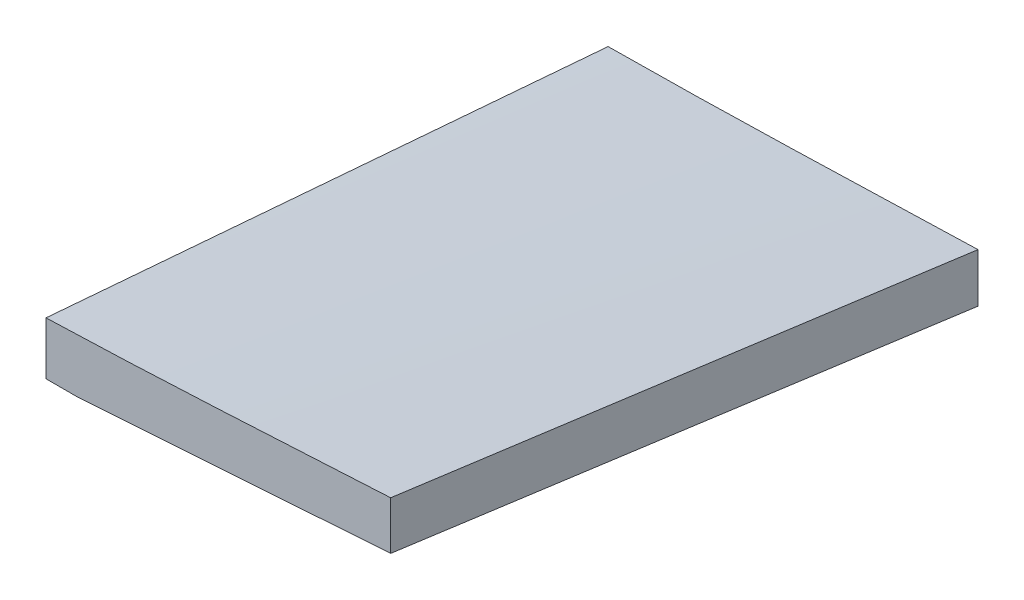
ISO-10303-21;
HEADER;
FILE_DESCRIPTION(('STEP AP214'),'2;1');
FILE_NAME('part.step','',(''),(''),'','','');
FILE_SCHEMA(('AUTOMOTIVE_DESIGN { 1 0 10303 214 1 1 1 1 }'));
ENDSEC;
DATA;
#1=APPLICATION_CONTEXT('core data for automotive mechanical design processes');
#2=APPLICATION_PROTOCOL_DEFINITION('international standard','automotive_design',2000,#1);
#3=PRODUCT_CONTEXT('',#1,'mechanical');
#4=PRODUCT('Part','Part','',(#3));
#5=PRODUCT_RELATED_PRODUCT_CATEGORY('part','',(#4));
#6=PRODUCT_DEFINITION_FORMATION('','',#4);
#7=PRODUCT_DEFINITION_CONTEXT('part definition',#1,'design');
#8=PRODUCT_DEFINITION('design','',#6,#7);
#9=PRODUCT_DEFINITION_SHAPE('','',#8);
#10=(LENGTH_UNIT() NAMED_UNIT(*) SI_UNIT(.MILLI.,.METRE.));
#11=(NAMED_UNIT(*) PLANE_ANGLE_UNIT() SI_UNIT($,.RADIAN.));
#12=(NAMED_UNIT(*) SI_UNIT($,.STERADIAN.) SOLID_ANGLE_UNIT());
#13=UNCERTAINTY_MEASURE_WITH_UNIT(LENGTH_MEASURE(1.E-05),#10,'distance_accuracy_value','');
#14=(GEOMETRIC_REPRESENTATION_CONTEXT(3) GLOBAL_UNCERTAINTY_ASSIGNED_CONTEXT((#13)) GLOBAL_UNIT_ASSIGNED_CONTEXT((#10,
#11,#12)) REPRESENTATION_CONTEXT('',''));
#15=CARTESIAN_POINT('',(0.,0.,0.));
#16=DIRECTION('',(0.,0.,1.));
#17=DIRECTION('',(1.,0.,0.));
#18=AXIS2_PLACEMENT_3D('',#15,#16,#17);
#19=CARTESIAN_POINT('',(122.012987748225,6.34998004884585,335.28));
#20=DIRECTION('',(1.,0.,0.));
#21=DIRECTION('',(0.,1.,0.));
#22=AXIS2_PLACEMENT_3D('',#19,#20,#21);
#23=PLANE('',#22);
#24=CARTESIAN_POINT('',(122.012987748225,-12.8181238056028,477.520000000027));
#25=CARTESIAN_POINT('',(122.012987748225,-10.2309538996958,510.752779958252));
#26=CARTESIAN_POINT('',(122.012987748225,-7.64426444405944,543.98559730753));
#27=CARTESIAN_POINT('',(122.012987748225,-3.954516160517,591.398961223956));
#28=CARTESIAN_POINT('',(122.012987748225,-2.85106435992717,605.579477207998));
#29=CARTESIAN_POINT('',(122.012987748225,-1.74770003692421,619.759999999985));
#30=B_SPLINE_CURVE_WITH_KNOTS('',3,(#24,#25,#26,#27,#28,#29),.UNSPECIFIED.,.F.,.F.,(4,2,4),(0.,
100.000000008964,142.670150642037),.UNSPECIFIED.);
#31=CARTESIAN_POINT('',(122.012987748225,-12.8181238056028,477.520000000027));
#32=VERTEX_POINT('',#31);
#33=CARTESIAN_POINT('',(122.012987748225,-1.74770003692419,619.759999999985));
#34=VERTEX_POINT('',#33);
#35=EDGE_CURVE('E104',#32,#34,#30,.T.);
#36=ORIENTED_EDGE('',*,*,#35,.T.);
#37=DIRECTION('',(0.,1.,0.));
#38=VECTOR('',#37,1.);
#39=CARTESIAN_POINT('',(122.012987748225,6.34998004884585,619.76));
#40=LINE('',#39,#38);
#41=CARTESIAN_POINT('',(122.012987748225,11.6136738216531,619.759999999985));
#42=VERTEX_POINT('',#41);
#43=EDGE_CURVE('E51',#34,#42,#40,.T.);
#44=ORIENTED_EDGE('',*,*,#43,.T.);
#45=CARTESIAN_POINT('',(122.012987748225,11.6136738216531,619.759999999985));
#46=CARTESIAN_POINT('',(122.012987748225,9.67010293276692,596.053266549237));
#47=CARTESIAN_POINT('',(122.012987748225,7.72612491566221,572.346566490533));
#48=CARTESIAN_POINT('',(122.012987748225,3.83735462501573,524.933233157214));
#49=CARTESIAN_POINT('',(122.012987748225,1.89256235147395,501.226599882598));
#50=CARTESIAN_POINT('',(122.012987748225,-0.0526370502863722,477.520000000027));
#51=B_SPLINE_CURVE_WITH_KNOTS('',3,(#45,#46,#47,#48,#49,#50),.UNSPECIFIED.,.F.,.F.,(4,2,4),(0.,
71.3588123768819,142.717624753764),.UNSPECIFIED.);
#52=CARTESIAN_POINT('',(122.012987748225,-0.0526370502863598,477.520000000027));
#53=VERTEX_POINT('',#52);
#54=EDGE_CURVE('E71',#42,#53,#51,.T.);
#55=ORIENTED_EDGE('',*,*,#54,.T.);
#56=DIRECTION('',(0.,1.,0.));
#57=VECTOR('',#56,1.);
#58=CARTESIAN_POINT('',(122.012987748225,6.34998004884585,477.52));
#59=LINE('',#58,#57);
#60=EDGE_CURVE('E11',#32,#53,#59,.T.);
#61=ORIENTED_EDGE('',*,*,#60,.F.);
#62=EDGE_LOOP('',(#36,#44,#55,#61));
#63=FACE_BOUND('',#62,.T.);
#64=ADVANCED_FACE('F44',(#63),#23,.F.);
#65=CARTESIAN_POINT('',(0.,0.,619.76));
#66=DIRECTION('',(0.,0.,-1.));
#67=DIRECTION('',(-1.,0.,0.));
#68=AXIS2_PLACEMENT_3D('',#65,#66,#67);
#69=PLANE('',#68);
#70=DIRECTION('',(1.,0.,0.));
#71=VECTOR('',#70,1.);
#72=CARTESIAN_POINT('',(104.715608500928,-1.74770003692308,619.76));
#73=LINE('',#72,#71);
#74=CARTESIAN_POINT('',(129.715608500912,-1.74770003690514,619.76000000023));
#75=VERTEX_POINT('',#74);
#76=EDGE_CURVE('E159',#34,#75,#73,.T.);
#77=ORIENTED_EDGE('',*,*,#76,.T.);
#78=CARTESIAN_POINT('',(129.715608500928,-1.74770003692304,619.76));
#79=CARTESIAN_POINT('',(136.6265871033,-1.28365344115263,619.76));
#80=CARTESIAN_POINT('',(143.537565705671,-0.819606845382206,619.76));
#81=CARTESIAN_POINT('',(157.359522910415,0.108486346158673,619.76));
#82=CARTESIAN_POINT('',(164.270501512787,0.572532941929125,619.76));
#83=CARTESIAN_POINT('',(183.864602522024,1.88820419395677,619.76));
#84=CARTESIAN_POINT('',(196.547724928889,2.73982885021397,619.76));
#85=CARTESIAN_POINT('',(209.230847335754,3.59145350647108,619.76));
#86=B_SPLINE_CURVE_WITH_KNOTS('',3,(#78,#79,#80,#81,#82,#83,#84,#85),.UNSPECIFIED.,.F.,.F.,(4,2,
2,4),(0.,20.7796217571299,41.5592435142597,79.694289428537),.UNSPECIFIED.);
#87=CARTESIAN_POINT('',(209.230847335754,3.59145350647108,619.76));
#88=VERTEX_POINT('',#87);
#89=EDGE_CURVE('E109',#75,#88,#86,.T.);
#90=ORIENTED_EDGE('',*,*,#89,.T.);
#91=DIRECTION('',(0.,1.,0.));
#92=VECTOR('',#91,1.);
#93=CARTESIAN_POINT('',(209.230847335755,-23.8937090007613,619.76));
#94=LINE('',#93,#92);
#95=CARTESIAN_POINT('',(209.230847335754,15.7935965768529,619.76));
#96=VERTEX_POINT('',#95);
#97=EDGE_CURVE('E106',#88,#96,#94,.T.);
#98=ORIENTED_EDGE('',*,*,#97,.T.);
#99=CARTESIAN_POINT('',(209.230847335754,15.7935965768529,619.76));
#100=CARTESIAN_POINT('',(207.41455686942,15.6924259805078,619.76));
#101=CARTESIAN_POINT('',(205.59822489933,15.5920060372144,619.76));
#102=CARTESIAN_POINT('',(201.965503035907,15.3922434325193,619.76));
#103=CARTESIAN_POINT('',(200.149113142617,15.2929007703145,619.76));
#104=CARTESIAN_POINT('',(196.516298559292,15.0948685949099,619.76));
#105=CARTESIAN_POINT('',(194.699873869272,14.9961790814402,619.76));
#106=CARTESIAN_POINT('',(191.066983914362,14.799556288656,619.76));
#107=CARTESIAN_POINT('',(189.250518649481,14.7016230091847,619.76));
#108=CARTESIAN_POINT('',(185.617613897391,14.506447661882,619.76));
#109=CARTESIAN_POINT('',(183.801174411456,14.4092055703053,619.76));
#110=CARTESIAN_POINT('',(180.168263251,14.2153050009613,619.76));
#111=CARTESIAN_POINT('',(178.351791576461,14.118646523525,619.76));
#112=CARTESIAN_POINT('',(175.627056123042,13.9741674535704,619.76));
#113=CARTESIAN_POINT('',(174.718805829373,13.9260925123853,619.76));
#114=CARTESIAN_POINT('',(172.902296675919,13.8301047893721,619.76));
#115=CARTESIAN_POINT('',(171.994037816134,13.7821920075444,619.76));
#116=CARTESIAN_POINT('',(169.26922968809,13.6389887519546,619.76));
#117=CARTESIAN_POINT('',(167.452652180701,13.5442335446287,619.76));
#118=CARTESIAN_POINT('',(163.819174875551,13.3571040707853,619.76));
#119=CARTESIAN_POINT('',(162.00227506427,13.2647300658146,619.76));
#120=CARTESIAN_POINT('',(158.368307089354,13.083401958186,619.76));
#121=CARTESIAN_POINT('',(156.551238925987,12.9944478501378,619.76));
#122=CARTESIAN_POINT('',(152.91690965229,12.8207031406438,619.76));
#123=CARTESIAN_POINT('',(151.099648542678,12.7359125241909,619.76));
#124=CARTESIAN_POINT('',(147.464914387711,12.5711121863996,619.76));
#125=CARTESIAN_POINT('',(145.647441343007,12.491102450726,619.76));
#126=CARTESIAN_POINT('',(142.012216761942,12.3364801875576,619.76));
#127=CARTESIAN_POINT('',(140.194465219438,12.2618678043317,619.76));
#128=CARTESIAN_POINT('',(136.55874343715,12.1179672827826,619.76));
#129=CARTESIAN_POINT('',(134.740773196422,12.0486791682962,619.76));
#130=CARTESIAN_POINT('',(131.10461974591,11.9153508402923,619.76));
#131=CARTESIAN_POINT('',(129.286436533956,11.8513106859325,619.76));
#132=CARTESIAN_POINT('',(125.649858896885,11.7285170643905,619.76));
#133=CARTESIAN_POINT('',(123.831464468559,11.6697636922556,619.76));
#134=CARTESIAN_POINT('',(122.012987748173,11.6136738216527,619.76));
#135=B_SPLINE_CURVE_WITH_KNOTS('',3,(#99,#100,#101,#102,#103,#104,#105,#106,#107,#108,#109,#110,
#111,#112,#113,#114,#115,#116,#117,#118,#119,#120,#121,#122,#123,#124,#125,#126,#127,#128,#129,
#130,#131,#132,#133,#134),.UNSPECIFIED.,.F.,.F.,(4,2,2,2,2,2,2,2,2,2,2,2,2,2,2,2,2,4),(0.,
5.45731732806995,10.9146305873691,16.371941591456,21.829251464457,27.2863729411962,
32.7434975130182,35.4720627165319,38.2006279269674,43.6577682906292,49.1155055237518,
54.5732341540616,60.0309431107681,65.4886357019918,70.9464741211801,76.4043369737113,
81.8622613415949,87.3202838140671),.UNSPECIFIED.);
#136=EDGE_CURVE('E96',#96,#42,#135,.T.);
#137=ORIENTED_EDGE('',*,*,#136,.T.);
#138=ORIENTED_EDGE('',*,*,#43,.F.);
#139=EDGE_LOOP('',(#77,#90,#98,#137,#138));
#140=FACE_BOUND('',#139,.T.);
#141=ADVANCED_FACE('F108',(#140),#69,.F.);
#142=CARTESIAN_POINT('',(0.,0.,477.52));
#143=DIRECTION('',(0.,0.,-1.));
#144=DIRECTION('',(-1.,0.,0.));
#145=AXIS2_PLACEMENT_3D('',#142,#143,#144);
#146=PLANE('',#145);
#147=DIRECTION('',(1.,0.,0.));
#148=VECTOR('',#147,1.);
#149=CARTESIAN_POINT('',(114.323209263802,-12.8181238056049,477.52));
#150=LINE('',#149,#148);
#151=CARTESIAN_POINT('',(139.3232092638,-12.8181238056026,477.520000000029));
#152=VERTEX_POINT('',#151);
#153=EDGE_CURVE('E123',#32,#152,#150,.T.);
#154=ORIENTED_EDGE('',*,*,#153,.F.);
#155=ORIENTED_EDGE('',*,*,#60,.T.);
#156=CARTESIAN_POINT('',(215.621917541989,2.25574454634471,477.52));
#157=CARTESIAN_POINT('',(214.647044605365,2.224288392323,477.52));
#158=CARTESIAN_POINT('',(213.67216500944,2.19303949664612,477.52));
#159=CARTESIAN_POINT('',(211.722394914279,2.13088505525722,477.52));
#160=CARTESIAN_POINT('',(210.747504415045,2.09997950952898,477.52));
#161=CARTESIAN_POINT('',(208.797715604077,2.03844062258157,477.52));
#162=CARTESIAN_POINT('',(207.82281729235,2.00780728114808,477.52));
#163=CARTESIAN_POINT('',(205.873014622828,1.94673327865421,477.52));
#164=CARTESIAN_POINT('',(204.898110265033,1.91629261759682,477.52));
#165=CARTESIAN_POINT('',(201.973390033636,1.82523005415367,477.52));
#166=CARTESIAN_POINT('',(200.023566075061,1.76486754230643,477.52));
#167=CARTESIAN_POINT('',(196.123895541607,1.64489301308431,477.52));
#168=CARTESIAN_POINT('',(194.174048966735,1.58528099552785,477.52));
#169=CARTESIAN_POINT('',(190.274399309307,1.46677611513231,477.52));
#170=CARTESIAN_POINT('',(188.324596227481,1.40788322828511,477.52));
#171=CARTESIAN_POINT('',(184.42496974022,1.29073730791751,477.52));
#172=CARTESIAN_POINT('',(182.475146334773,1.23248427475644,477.52));
#173=CARTESIAN_POINT('',(179.550393645504,1.14566147571709,477.52));
#174=CARTESIAN_POINT('',(178.575472624049,1.1168133190096,477.52));
#175=CARTESIAN_POINT('',(176.625625349061,1.0592944631072,477.52));
#176=CARTESIAN_POINT('',(175.650699095529,1.0306237639128,477.52));
#177=CARTESIAN_POINT('',(172.725900323917,0.945169580461794,477.52));
#178=CARTESIAN_POINT('',(170.776011391535,0.888944118170222,477.52));
#179=CARTESIAN_POINT('',(166.875956369448,0.77899210724675,477.52));
#180=CARTESIAN_POINT('',(164.925790272231,0.72526582335519,477.52));
#181=CARTESIAN_POINT('',(161.025365213215,0.621389081226013,477.52));
#182=CARTESIAN_POINT('',(159.075106251561,0.571238617557935,477.52));
#183=CARTESIAN_POINT('',(155.174486893242,0.47532787099128,477.52));
#184=CARTESIAN_POINT('',(153.224126496968,0.429567572283645,477.52));
#185=CARTESIAN_POINT('',(149.323298336082,0.343127637481132,477.52));
#186=CARTESIAN_POINT('',(147.372830571813,0.30244798599696,477.52));
#187=CARTESIAN_POINT('',(143.471732392745,0.226864321897372,477.52));
#188=CARTESIAN_POINT('',(141.521101975046,0.191960458572466,477.52));
#189=CARTESIAN_POINT('',(137.619739338344,0.127837378134033,477.52));
#190=CARTESIAN_POINT('',(135.669007118928,0.098618186243909,477.52));
#191=CARTESIAN_POINT('',(131.767444825237,0.0457651582251589,477.52));
#192=CARTESIAN_POINT('',(129.81661475011,0.0221313848305931,477.52));
#193=CARTESIAN_POINT('',(126.890307741431,-0.00911154197840539,477.52));
#194=CARTESIAN_POINT('',(125.914852880334,-0.0188246312667157,477.52));
#195=CARTESIAN_POINT('',(123.963929885645,-0.0368154889645691,477.52));
#196=CARTESIAN_POINT('',(122.988461752051,-0.0450932573088259,477.52));
#197=CARTESIAN_POINT('',(122.012987748173,-0.052637050288963,477.52));
#198=B_SPLINE_CURVE_WITH_KNOTS('',3,(#156,#157,#158,#159,#160,#161,#162,#163,#164,#165,#166,
#167,#168,#169,#170,#171,#172,#173,#174,#175,#176,#177,#178,#179,#180,#181,#182,#183,#184,#185,
#186,#187,#188,#189,#190,#191,#192,#193,#194,#195,#196,#197),.UNSPECIFIED.,.F.,.F.,(4,2,2,2,2,2,
2,2,2,2,2,2,2,2,2,2,2,2,2,2,4),(0.,2.92614084149174,5.85228154467963,8.77841994370649,
11.7045583880756,17.5568324945537,23.4091051850171,29.2611819606866,35.1132620224934,
38.0393052238479,40.9653484336475,46.8174456482294,52.6701613758528,58.5228682149949,
64.375553977651,70.2282220120763,76.0810413005542,81.9338865579291,87.7867975499124,
90.7133063005583,93.6398151843176),.UNSPECIFIED.);
#199=CARTESIAN_POINT('',(215.621917541989,2.25574454634471,477.52));
#200=VERTEX_POINT('',#199);
#201=EDGE_CURVE('E64',#200,#53,#198,.T.);
#202=ORIENTED_EDGE('',*,*,#201,.F.);
#203=DIRECTION('',(0.,1.,0.));
#204=VECTOR('',#203,1.);
#205=CARTESIAN_POINT('',(215.62191754199,-23.8937090007613,477.52));
#206=LINE('',#205,#204);
#207=CARTESIAN_POINT('',(215.621917541989,-10.1485424623587,477.52));
#208=VERTEX_POINT('',#207);
#209=EDGE_CURVE('E114',#208,#200,#206,.T.);
#210=ORIENTED_EDGE('',*,*,#209,.F.);
#211=CARTESIAN_POINT('',(139.323209263802,-12.8181238056049,477.52));
#212=CARTESIAN_POINT('',(146.245514006947,-12.5759223842232,477.52));
#213=CARTESIAN_POINT('',(153.167818750092,-12.3337209628415,477.52));
#214=CARTESIAN_POINT('',(167.012428236382,-11.8493181200781,477.52));
#215=CARTESIAN_POINT('',(173.934732979527,-11.6071166986964,477.52));
#216=CARTESIAN_POINT('',(192.445330995778,-10.9594576723294,477.52));
#217=CARTESIAN_POINT('',(204.033624268884,-10.554000067344,477.52));
#218=CARTESIAN_POINT('',(215.621917541989,-10.1485424623587,477.52));
#219=B_SPLINE_CURVE_WITH_KNOTS('',3,(#211,#212,#213,#214,#215,#216,#217,#218),.UNSPECIFIED.,.F.,
.F.,(4,2,2,4),(0.,20.7796217571299,41.5592435142597,76.3453963868684),.UNSPECIFIED.);
#220=EDGE_CURVE('E201',#152,#208,#219,.T.);
#221=ORIENTED_EDGE('',*,*,#220,.F.);
#222=EDGE_LOOP('',(#154,#155,#202,#210,#221));
#223=FACE_BOUND('',#222,.T.);
#224=ADVANCED_FACE('F166',(#223),#146,.T.);
#225=CARTESIAN_POINT('',(222.012987748225,-23.8937090007613,335.28));
#226=DIRECTION('',(0.998992101682105,0.,0.0448863094581294));
#227=DIRECTION('',(0.,1.,0.));
#228=AXIS2_PLACEMENT_3D('',#225,#226,#227);
#229=PLANE('',#228);
#230=CARTESIAN_POINT('',(222.012987748225,-23.8937090007613,335.28));
#231=CARTESIAN_POINT('',(215.621950375233,-10.1464646900732,477.519269261564));
#232=CARTESIAN_POINT('',(209.230888497717,3.59504253956158,619.759083897143));
#233=CARTESIAN_POINT('',(202.839777129521,17.3249682784286,762.));
#234=B_SPLINE_CURVE_WITH_KNOTS('',3,(#230,#231,#232,#233),.UNSPECIFIED.,.F.,.F.,(4,4),(0.,1.),.UNSPECIFIED.);
#235=EDGE_CURVE('E118',#208,#88,#234,.T.);
#236=ORIENTED_EDGE('',*,*,#235,.F.);
#237=ORIENTED_EDGE('',*,*,#209,.T.);
#238=CARTESIAN_POINT('',(222.012987748225,-11.2872773614073,335.28));
#239=CARTESIAN_POINT('',(215.621950375233,2.25782306949605,477.519269261564));
#240=CARTESIAN_POINT('',(209.230888497717,15.7971864193462,619.759083897143));
#241=CARTESIAN_POINT('',(202.839777129521,29.3249682784286,762.));
#242=B_SPLINE_CURVE_WITH_KNOTS('',3,(#238,#239,#240,#241),.UNSPECIFIED.,.F.,.F.,(4,4),(0.,1.),.UNSPECIFIED.);
#243=EDGE_CURVE('E100',#200,#96,#242,.T.);
#244=ORIENTED_EDGE('',*,*,#243,.T.);
#245=ORIENTED_EDGE('',*,*,#97,.F.);
#246=EDGE_LOOP('',(#236,#237,#244,#245));
#247=FACE_BOUND('',#246,.T.);
#248=ADVANCED_FACE('F116',(#247),#229,.T.);
#249=CARTESIAN_POINT('',(222.012987748225,-11.2872773614073,335.28));
#250=CARTESIAN_POINT('',(215.621950375233,2.25782306949605,477.519269261564));
#251=CARTESIAN_POINT('',(209.230888497717,15.7971864193462,619.759083897143));
#252=CARTESIAN_POINT('',(202.839777129521,29.3249682784286,762.));
#253=CARTESIAN_POINT('',(218.569474026706,-11.3263744236417,335.28));
#254=CARTESIAN_POINT('',(212.364886061197,2.15272535408958,477.519269261564));
#255=CARTESIAN_POINT('',(206.160273591164,15.6260880507676,619.759083897143));
#256=CARTESIAN_POINT('',(199.955611630451,29.0878692566778,762.));
#257=CARTESIAN_POINT('',(211.614338336714,-11.4024470677598,335.28));
#258=CARTESIAN_POINT('',(205.825097972641,1.94636141574157,477.519269261565));
#259=CARTESIAN_POINT('',(200.035833104044,15.2894328181897,619.759083897143));
#260=CARTESIAN_POINT('',(194.246518744766,28.62092272987,762.));
#261=CARTESIAN_POINT('',(201.046202820784,-11.5155355801604,335.28));
#262=CARTESIAN_POINT('',(195.960183316022,1.64100708519495,477.519269261564));
#263=CARTESIAN_POINT('',(190.874139306737,14.791812669497,619.759083897143));
#264=CARTESIAN_POINT('',(185.788045806771,27.9310367630314,762.));
#265=CARTESIAN_POINT('',(190.421562401009,-11.6239646215105,335.28));
#266=CARTESIAN_POINT('',(186.071163978279,1.34135026762067,477.519269261564));
#267=CARTESIAN_POINT('',(181.720741051026,14.3009280756986,619.759083897143));
#268=CARTESIAN_POINT('',(177.370268633092,27.2489243930088,761.999999999999));
#269=CARTESIAN_POINT('',(183.356302448994,-11.6915854526342,335.28));
#270=CARTESIAN_POINT('',(179.48576660961,1.1454855942834,477.519269261564));
#271=CARTESIAN_POINT('',(175.615206265701,13.9768195601478,619.759083897143));
#272=CARTESIAN_POINT('',(171.744596431112,26.7965720352444,762.));
#273=CARTESIAN_POINT('',(174.388523129358,-11.7731432923107,335.28));
#274=CARTESIAN_POINT('',(171.103001578197,0.899059371477806,477.519269261564));
#275=CARTESIAN_POINT('',(167.817455522512,13.5655249542131,619.759083897143));
#276=CARTESIAN_POINT('',(164.531859976147,26.2204090461806,762.));
#277=CARTESIAN_POINT('',(163.489709248502,-11.8633262155867,335.28));
#278=CARTESIAN_POINT('',(160.910936734288,0.60773809662375,477.519269261564));
#279=CARTESIAN_POINT('',(158.33213971555,13.073065327781,619.759083897143));
#280=CARTESIAN_POINT('',(155.753293206132,25.5268110681705,761.999999999999));
#281=CARTESIAN_POINT('',(147.154849918996,-11.9140829368556,335.28));
#282=CARTESIAN_POINT('',(145.626036317623,0.251017379627905,477.519269261565));
#283=CARTESIAN_POINT('',(144.097198211725,12.4103806150582,619.759083897144));
#284=CARTESIAN_POINT('',(142.568310615148,24.5581623597207,762.000000000001));
#285=CARTESIAN_POINT('',(133.547087797304,-11.8513571386047,335.28));
#286=CARTESIAN_POINT('',(132.888447204188,0.0521462593199381,477.519269261564));
#287=CARTESIAN_POINT('',(132.229782106547,11.9499125761914,619.759083897143));
#288=CARTESIAN_POINT('',(131.571067518226,23.8360974022951,762.));
#289=CARTESIAN_POINT('',(122.659949238186,-11.7410017797558,335.280000000001));
#290=CARTESIAN_POINT('',(122.697140743006,-0.0501019891075296,477.519269261565));
#291=CARTESIAN_POINT('',(122.734307743302,11.6350607204876,619.759083897143));
#292=CARTESIAN_POINT('',(122.771425252918,23.3086419393149,762.));
#293=CARTESIAN_POINT('',(114.493192339325,-11.6262316691835,335.28));
#294=CARTESIAN_POINT('',(115.052736661929,-0.0970194846432594,477.519269261564));
#295=CARTESIAN_POINT('',(115.612256480008,11.4264556188438,619.759083897143));
#296=CARTESIAN_POINT('',(116.171726807407,22.938349231563,761.999999999999));
#297=CARTESIAN_POINT('',(106.324095444975,-11.4813070111323,335.28));
#298=CARTESIAN_POINT('',(107.407102717467,-0.115334106030914,477.519269261564));
#299=CARTESIAN_POINT('',(108.490085485435,11.2449017180172,619.759083897143));
#300=CARTESIAN_POINT('',(109.573018762723,22.5935560512976,762.));
#301=CARTESIAN_POINT('',(98.1517013141778,-11.3060491598229,335.28));
#302=CARTESIAN_POINT('',(99.7599490935271,-0.105289853007253,477.519269261565));
#303=CARTESIAN_POINT('',(101.368172368352,11.0897323727552,619.759083897144));
#304=CARTESIAN_POINT('',(102.976346152497,22.2731731077499,762.000000000001));
#305=CARTESIAN_POINT('',(89.9750279012389,-11.1021701951475,335.28));
#306=CARTESIAN_POINT('',(92.1109614058318,-0.0686157488297257,477.519269261564));
#307=CARTESIAN_POINT('',(94.2468704059006,10.9592016164349,619.759083897143));
#308=CARTESIAN_POINT('',(96.3827299152893,21.9754374909317,762.));
#309=CARTESIAN_POINT('',(81.7931246917491,-10.8683806880935,335.28));
#310=CARTESIAN_POINT('',(84.4597450626571,-0.00268226262042188,477.519269261565));
#311=CARTESIAN_POINT('',(87.1263409290411,10.8572790817994,619.759083897144));
#312=CARTESIAN_POINT('',(89.7928873047449,21.7056589354515,762.));
#313=CARTESIAN_POINT('',(73.6060212603565,-10.5736728833086,335.279999999999));
#314=CARTESIAN_POINT('',(76.8063043911992,0.122433158677056,477.519269261564));
#315=CARTESIAN_POINT('',(80.0065630175178,10.8128021196095,619.759083897143));
#316=CARTESIAN_POINT('',(83.2067721531562,21.4915895897743,762.));
#317=CARTESIAN_POINT('',(65.4143764421152,-10.1899300133236,335.28));
#318=CARTESIAN_POINT('',(69.1513913096214,0.331870983608891,477.519269261565));
#319=CARTESIAN_POINT('',(72.8883816726035,10.8479348994881,619.759083897144));
#320=CARTESIAN_POINT('',(76.6253225449055,21.3524173245996,762.));
#321=CARTESIAN_POINT('',(57.218819398707,-9.70421420475117,335.28));
#322=CARTESIAN_POINT('',(61.4959487597233,0.637407086376427,477.519269261564));
#323=CARTESIAN_POINT('',(65.7730536162154,10.9732912964508,619.759083897143));
#324=CARTESIAN_POINT('',(70.0501089820274,21.2975940157574,762.));
#325=CARTESIAN_POINT('',(51.753855165005,-9.29406576406763,335.28));
#326=CARTESIAN_POINT('',(56.3933077057463,0.923606423622542,477.519269261564));
#327=CARTESIAN_POINT('',(61.0327357419635,11.1355415302595,619.759083897143));
#328=CARTESIAN_POINT('',(65.6721142875005,21.3358951461287,762.));
#329=CARTESIAN_POINT('',(47.9240317369891,-8.96448844964143,335.28));
#330=CARTESIAN_POINT('',(52.818089020236,1.16404685916252,477.519269261564));
#331=CARTESIAN_POINT('',(57.7121217989589,11.2868450869133,619.759083897143));
#332=CARTESIAN_POINT('',(62.6061050870016,21.3980618238962,762.));
#333=CARTESIAN_POINT('',(45.7218209357501,-8.76534620327357,335.28));
#334=CARTESIAN_POINT('',(50.7660285067419,1.3113655323144,477.519269261564));
#335=CARTESIAN_POINT('',(55.8102115732095,11.3823401868492,619.759083897143));
#336=CARTESIAN_POINT('',(60.8543451489969,21.4417333506161,762.));
#337=CARTESIAN_POINT('',(42.4027754578273,-8.432707682147,335.280000000001));
#338=CARTESIAN_POINT('',(47.6828454316512,1.56346050757602,477.519269261565));
#339=CARTESIAN_POINT('',(52.9628909009511,11.5538916162458,619.759083897144));
#340=CARTESIAN_POINT('',(58.2428868795708,21.5327412341478,762.000000000001));
#341=CARTESIAN_POINT('',(39.0713826541202,-8.06384555902649,335.279999999999));
#342=CARTESIAN_POINT('',(44.5960375014028,1.84855027043535,477.519269261564));
#343=CARTESIAN_POINT('',(50.1206678441612,11.755209018844,619.759083897142));
#344=CARTESIAN_POINT('',(55.6452486962394,21.6502862764848,761.999999999999));
#345=CARTESIAN_POINT('',(35.7310935187291,-7.65734912890353,335.28));
#346=CARTESIAN_POINT('',(41.5071383578781,2.1677625802585,477.519269261565));
#347=CARTESIAN_POINT('',(47.283158692503,11.9871372083673,619.759083897144));
#348=CARTESIAN_POINT('',(53.0591295364477,21.7949303457084,762.000000000001));
#349=CARTESIAN_POINT('',(32.3856911285866,-7.21086412592674,335.28));
#350=CARTESIAN_POINT('',(38.4179939023169,2.52333107982961,477.519269261564));
#351=CARTESIAN_POINT('',(44.4502721715231,12.2517892045327,619.759083897143));
#352=CARTESIAN_POINT('',(50.4825009500491,21.9686658384681,761.999999999999));
#353=CARTESIAN_POINT('',(29.0388190535993,-6.72415739916843,335.28));
#354=CARTESIAN_POINT('',(35.3303071809232,2.91510782511942,477.519269261565));
#355=CARTESIAN_POINT('',(41.621770803723,12.5486359683541,619.759083897143));
#356=CARTESIAN_POINT('',(47.9131849358426,22.1705826208209,762.));
#357=CARTESIAN_POINT('',(25.6949743291155,-6.19196852419016,335.28));
#358=CARTESIAN_POINT('',(32.2467004538082,3.35008801111173,477.519269261565));
#359=CARTESIAN_POINT('',(38.7984020739767,12.8864074653604,619.759083897144));
#360=CARTESIAN_POINT('',(45.3500542034651,22.4111454288413,762.000000000001));
#361=CARTESIAN_POINT('',(22.9174344404017,-5.69180499526552,335.28));
#362=CARTESIAN_POINT('',(29.6847215388951,3.76530583704974,477.519269261564));
#363=CARTESIAN_POINT('',(36.4519841328644,13.2166795883118,619.759083897143));
#364=CARTESIAN_POINT('',(43.2191972361536,22.656471848806,761.999999999999));
#365=CARTESIAN_POINT('',(20.7051166447645,-5.24830690376412,335.28));
#366=CARTESIAN_POINT('',(27.6427855448402,4.13795801459049,477.519269261564));
#367=CARTESIAN_POINT('',(34.5804299403918,13.5184858518919,619.759083897144));
#368=CARTESIAN_POINT('',(41.5180248452633,22.8874321984255,762.));
#369=CARTESIAN_POINT('',(19.0522311011638,-4.89036823785229,335.28));
#370=CARTESIAN_POINT('',(26.1162869738974,4.44099244551772,477.519269261565));
#371=CARTESIAN_POINT('',(33.1803183421069,13.7666160478345,619.759083897144));
#372=CARTESIAN_POINT('',(40.2443002196361,23.0806581593835,762.000000000001));
#373=CARTESIAN_POINT('',(17.4072680026639,-4.50393109256964,335.28));
#374=CARTESIAN_POINT('',(24.5959209475556,4.77057979291317,477.519269261564));
#375=CARTESIAN_POINT('',(31.7845493879232,14.0393535973428,619.759083897143));
#376=CARTESIAN_POINT('',(38.9731283376106,23.2965459110046,761.999999999999));
#377=CARTESIAN_POINT('',(15.7719559277294,-4.08585733946278,335.279999999999));
#378=CARTESIAN_POINT('',(23.0830306833606,5.12953181584458,477.519269261564));
#379=CARTESIAN_POINT('',(30.3940809344676,14.3391838900987,619.759083897143));
#380=CARTESIAN_POINT('',(37.7050816948944,23.5372544735851,762.));
#381=CARTESIAN_POINT('',(14.1482110615158,-3.63320964201411,335.28));
#382=CARTESIAN_POINT('',(21.5791210658283,5.52064217750062,477.519269261565));
#383=CARTESIAN_POINT('',(29.0100065656166,14.6687569159621,619.759083897144));
#384=CARTESIAN_POINT('',(36.4408425747248,23.8052901636559,762.));
#385=CARTESIAN_POINT('',(12.5379887560416,-3.14346189168235,335.28));
#386=CARTESIAN_POINT('',(20.0857854765168,5.94643031634065,477.519269261564));
#387=CARTESIAN_POINT('',(27.6335576924679,15.0305854433104,619.759083897143));
#388=CARTESIAN_POINT('',(35.1812804177387,24.1031590795125,762.));
#389=CARTESIAN_POINT('',(10.9443022314088,-2.61171665583038,335.28));
#390=CARTESIAN_POINT('',(18.6055358798854,6.41151219142834,477.519269261564));
#391=CARTESIAN_POINT('',(26.2667450238378,15.4290039576339,619.759083897143));
#392=CARTESIAN_POINT('',(33.92790467711,24.4349142330716,762.));
#393=CARTESIAN_POINT('',(9.3696983908296,-2.03559280479495,335.28));
#394=CARTESIAN_POINT('',(17.140516523627,6.9183980534325,477.519269261565));
#395=CARTESIAN_POINT('',(24.9113101519002,15.8666518306067,619.759083897144));
#396=CARTESIAN_POINT('',(32.6820542894933,24.8033241170132,762.));
#397=CARTESIAN_POINT('',(7.81930606312509,-1.40676584170021,335.28));
#398=CARTESIAN_POINT('',(15.6951423376886,7.47472087107555,477.519269261564));
#399=CARTESIAN_POINT('',(23.5709541077281,16.3504705027981,619.759083897143));
#400=CARTESIAN_POINT('',(31.4467163870874,25.2146386437529,761.999999999999));
#401=CARTESIAN_POINT('',(6.2945427283012,-0.728623104338553,335.28));
#402=CARTESIAN_POINT('',(14.270722157368,8.07829784576766,477.519269261565));
#403=CARTESIAN_POINT('',(22.2468770819107,16.8794817148207,619.759083897144));
#404=CARTESIAN_POINT('',(30.2229825157733,25.6690840931059,762.000000000001));
#405=CARTESIAN_POINT('',(4.81910701938389,0.0452105722964347,335.28));
#406=CARTESIAN_POINT('',(12.8897475080532,8.77532558765721,477.519269261564));
#407=CARTESIAN_POINT('',(20.9603634921985,17.4997035219648,619.759083897142));
#408=CARTESIAN_POINT('',(29.0309299856635,26.2124999655045,761.999999999998));
#409=CARTESIAN_POINT('',(3.44019696912771,0.973032127436344,335.28));
#410=CARTESIAN_POINT('',(11.5941800006254,9.61860132023108,477.519269261566));
#411=CARTESIAN_POINT('',(19.748138527599,18.2584334319726,619.759083897145));
#412=CARTESIAN_POINT('',(27.9020475638924,26.8866840529463,762.000000000003));
#413=CARTESIAN_POINT('',(2.18607039010745,2.05737434257256,335.28));
#414=CARTESIAN_POINT('',(10.4107564395223,10.6111710650528,477.519269261563));
#415=CARTESIAN_POINT('',(18.6354179844131,19.1592307064798,619.759083897141));
#416=CARTESIAN_POINT('',(26.8600300386238,27.6957088571391,761.999999999997));
#417=CARTESIAN_POINT('',(1.27839650729546,3.09358418996593,335.28));
#418=CARTESIAN_POINT('',(9.54912891024288,11.5662188458673,477.519269261565));
#419=CARTESIAN_POINT('',(17.8198368086662,20.0331164207154,619.759083897144));
#420=CARTESIAN_POINT('',(26.0904952164094,28.4884325047958,762.000000000001));
#421=CARTESIAN_POINT('',(0.675104053522571,4.01206497822802,335.28));
#422=CARTESIAN_POINT('',(8.9756319822023,12.418850021307,477.519269261564));
#423=CARTESIAN_POINT('',(17.2761354063579,20.8198979833327,619.759083897143));
#424=CARTESIAN_POINT('',(25.5765893398334,29.2093644545907,761.999999999999));
#425=CARTESIAN_POINT('',(0.311283524258083,4.74838484159257,335.28));
#426=CARTESIAN_POINT('',(8.62885568345465,13.1054382128106,477.519269261565));
#427=CARTESIAN_POINT('',(16.9464033381271,21.4567545029755,619.759083897144));
#428=CARTESIAN_POINT('',(25.2639015021194,29.7964893023725,762.));
#429=CARTESIAN_POINT('',(0.0633372908855968,5.53486679411943,335.28));
#430=CARTESIAN_POINT('',(8.3922174754818,13.8408332089873,477.519269261564));
#431=CARTESIAN_POINT('',(16.7210731555539,22.141062542802,619.759083897143));
#432=CARTESIAN_POINT('',(25.0498793449458,30.4297103858489,761.999999999999));
#433=CARTESIAN_POINT('',(9.29076906829817E-07,6.07768392100159,335.28));
#434=CARTESIAN_POINT('',(8.3334947321307,14.3508356613562,477.519269261564));
#435=CARTESIAN_POINT('',(16.6669640306604,22.6182503206576,619.759083897143));
#436=CARTESIAN_POINT('',(25.0003838385099,30.8740834891911,762.));
#437=CARTESIAN_POINT('',(9.29077044083409E-07,6.34998004884586,335.28));
#438=CARTESIAN_POINT('',(8.33349473213078,14.6065062308661,477.519269261564));
#439=CARTESIAN_POINT('',(16.6669640306604,22.8572953318332,619.759083897143));
#440=CARTESIAN_POINT('',(25.0003838385099,31.0965029420325,762.));
#441=B_SPLINE_SURFACE_WITH_KNOTS('',3,3,((#249,#250,#251,#252),(#253,#254,#255,#256),(#257,#258,
#259,#260),(#261,#262,#263,#264),(#265,#266,#267,#268),(#269,#270,#271,#272),(#273,#274,#275,
#276),(#277,#278,#279,#280),(#281,#282,#283,#284),(#285,#286,#287,#288),(#289,#290,#291,#292),
(#293,#294,#295,#296),(#297,#298,#299,#300),(#301,#302,#303,#304),(#305,#306,#307,#308),(#309,
#310,#311,#312),(#313,#314,#315,#316),(#317,#318,#319,#320),(#321,#322,#323,#324),(#325,#326,
#327,#328),(#329,#330,#331,#332),(#333,#334,#335,#336),(#337,#338,#339,#340),(#341,#342,#343,
#344),(#345,#346,#347,#348),(#349,#350,#351,#352),(#353,#354,#355,#356),(#357,#358,#359,#360),
(#361,#362,#363,#364),(#365,#366,#367,#368),(#369,#370,#371,#372),(#373,#374,#375,#376),(#377,
#378,#379,#380),(#381,#382,#383,#384),(#385,#386,#387,#388),(#389,#390,#391,#392),(#393,#394,
#395,#396),(#397,#398,#399,#400),(#401,#402,#403,#404),(#405,#406,#407,#408),(#409,#410,#411,
#412),(#413,#414,#415,#416),(#417,#418,#419,#420),(#421,#422,#423,#424),(#425,#426,#427,#428),
(#429,#430,#431,#432),(#433,#434,#435,#436),(#437,#438,#439,#440)),.UNSPECIFIED.,.F.,.F.,.F.,(4,
1,1,1,2,1,1,1,1,1,1,1,1,1,1,1,1,2,1,1,1,1,1,1,1,1,1,1,1,1,1,1,1,1,1,1,1,1,1,1,1,1,1,4),(4,4),
(0.,0.0210721432720827,0.0421442865441653,0.063216429816248,0.0842885730883306,
0.116982404956549,0.149676236824766,0.182370068692984,0.198716984627093,0.215063900561202,
0.231410816495311,0.24775773242942,0.264104648363529,0.280451564297638,0.296798480231747,
0.313145396165856,0.329492312099965,0.345839228034074,0.352409679753848,0.358980131473621,
0.365550583193395,0.372121034913169,0.378691486632943,0.385261938352717,0.39183239007249,
0.398402841792264,0.401688067652151,0.404973293512038,0.408258519371925,0.411543745231812,
0.414828971091699,0.418114196951585,0.421399422811472,0.424684648671359,0.427969874531246,
0.431255100391133,0.43454032625102,0.437825552110907,0.441110777970794,0.444396003830681,
0.446038616760624,0.447681229690568,0.449323842620511,0.450966455550454),(0.,1.),.UNSPECIFIED.);
#442=ORIENTED_EDGE('',*,*,#243,.F.);
#443=ORIENTED_EDGE('',*,*,#201,.T.);
#444=ORIENTED_EDGE('',*,*,#54,.F.);
#445=ORIENTED_EDGE('',*,*,#136,.F.);
#446=EDGE_LOOP('',(#442,#443,#444,#445));
#447=FACE_BOUND('',#446,.T.);
#448=ADVANCED_FACE('F98',(#447),#441,.T.);
#449=CARTESIAN_POINT('',(148.93082104307,-23.8937090007613,335.28));
#450=CARTESIAN_POINT('',(139.323254044884,-12.8160361171643,477.519269261564));
#451=CARTESIAN_POINT('',(129.715662542174,-1.74410031462064,619.759083897143));
#452=CARTESIAN_POINT('',(120.108021548784,9.31625399715528,762.));
#453=CARTESIAN_POINT('',(155.021001601833,-23.8937090007613,335.28));
#454=CARTESIAN_POINT('',(145.68147873908,-12.5935718315734,477.519269261564));
#455=CARTESIAN_POINT('',(136.341931371802,-1.29917174343879,619.759083897143));
#456=CARTESIAN_POINT('',(127.002334513845,9.98364685392806,762.));
#457=CARTESIAN_POINT('',(167.201362719359,-23.8937090007613,335.28));
#458=CARTESIAN_POINT('',(158.397928127471,-12.1486432603916,477.519269261565));
#459=CARTESIAN_POINT('',(149.59446903106,-0.409314601075073,619.759083897144));
#460=CARTESIAN_POINT('',(140.790960443968,11.3184325674736,762.));
#461=CARTESIAN_POINT('',(185.471904395647,-23.8937090007613,335.28));
#462=CARTESIAN_POINT('',(177.472602210058,-11.4812504036188,477.519269261564));
#463=CARTESIAN_POINT('',(169.473275519945,0.925471112470457,619.759083897143));
#464=CARTESIAN_POINT('',(161.473899339152,13.3206111377919,762.));
#465=CARTESIAN_POINT('',(203.742446071936,-23.8937090007613,335.28));
#466=CARTESIAN_POINT('',(196.547276292646,-10.813857546846,477.519269261564));
#467=CARTESIAN_POINT('',(189.352082008831,2.26025682601603,619.759083897143));
#468=CARTESIAN_POINT('',(182.156838234336,15.3227897081103,761.999999999999));
#469=CARTESIAN_POINT('',(215.922807189462,-23.8937090007613,335.28));
#470=CARTESIAN_POINT('',(209.263725681037,-10.3689289756642,477.519269261564));
#471=CARTESIAN_POINT('',(202.604619668088,3.15011396837973,619.759083897143));
#472=CARTESIAN_POINT('',(195.945464164459,16.6575754216558,762.));
#473=CARTESIAN_POINT('',(222.012987748225,-23.8937090007613,335.28));
#474=CARTESIAN_POINT('',(215.621950375233,-10.1464646900732,477.519269261564));
#475=CARTESIAN_POINT('',(209.230888497717,3.59504253956158,619.759083897143));
#476=CARTESIAN_POINT('',(202.839777129521,17.3249682784286,762.));
#477=B_SPLINE_SURFACE_WITH_KNOTS('',3,3,((#449,#450,#451,#452),(#453,#454,#455,#456),(#457,#458,
#459,#460),(#461,#462,#463,#464),(#465,#466,#467,#468),(#469,#470,#471,#472),(#473,#474,#475,
#476)),.UNSPECIFIED.,.F.,.F.,.F.,(4,1,1,1,4),(4,4),(0.796773836641175,0.840719353183708,
0.884664869726241,0.928610386268774,0.972555902811307),(0.,1.),.UNSPECIFIED.);
#478=CARTESIAN_POINT('',(148.93082104307,-23.8937090007613,335.28));
#479=CARTESIAN_POINT('',(139.323254044884,-12.8160361171643,477.519269261564));
#480=CARTESIAN_POINT('',(129.715662542174,-1.74410031462064,619.759083897143));
#481=CARTESIAN_POINT('',(120.108021548784,9.31625399715528,762.));
#482=B_SPLINE_CURVE_WITH_KNOTS('',3,(#478,#479,#480,#481),.UNSPECIFIED.,.F.,.F.,(4,4),(0.,1.),.UNSPECIFIED.);
#483=EDGE_CURVE('E57',#152,#75,#482,.T.);
#484=ORIENTED_EDGE('',*,*,#483,.F.);
#485=ORIENTED_EDGE('',*,*,#220,.T.);
#486=ORIENTED_EDGE('',*,*,#235,.T.);
#487=ORIENTED_EDGE('',*,*,#89,.F.);
#488=EDGE_LOOP('',(#484,#485,#486,#487));
#489=FACE_BOUND('',#488,.T.);
#490=ADVANCED_FACE('F160',(#489),#477,.T.);
#491=CARTESIAN_POINT('',(98.93082104307,-23.8937090007613,335.28));
#492=CARTESIAN_POINT('',(89.323254044884,-12.8160361171643,477.519269261564));
#493=CARTESIAN_POINT('',(79.7156625421738,-1.74410031462064,619.759083897143));
#494=CARTESIAN_POINT('',(70.1080215487835,9.31625399715528,762.));
#495=CARTESIAN_POINT('',(103.097487709737,-23.8937090007613,335.28));
#496=CARTESIAN_POINT('',(93.4899207115506,-12.8160361171643,477.519269261564));
#497=CARTESIAN_POINT('',(83.8823292088405,-1.74410031462064,619.759083897143));
#498=CARTESIAN_POINT('',(74.2746882154502,9.31625399715528,762.));
#499=CARTESIAN_POINT('',(111.43082104307,-23.8937090007613,335.28));
#500=CARTESIAN_POINT('',(101.823254044884,-12.8160361171643,477.519269261564));
#501=CARTESIAN_POINT('',(92.2156625421738,-1.74410031462064,619.759083897143));
#502=CARTESIAN_POINT('',(82.6080215487835,9.31625399715527,762.));
#503=CARTESIAN_POINT('',(123.93082104307,-23.8937090007613,335.280000000001));
#504=CARTESIAN_POINT('',(114.323254044884,-12.8160361171644,477.519269261565));
#505=CARTESIAN_POINT('',(104.715662542174,-1.74410031462064,619.759083897144));
#506=CARTESIAN_POINT('',(95.1080215487836,9.3162539971553,762.000000000001));
#507=CARTESIAN_POINT('',(136.43082104307,-23.8937090007613,335.279999999999));
#508=CARTESIAN_POINT('',(126.823254044884,-12.8160361171643,477.519269261564));
#509=CARTESIAN_POINT('',(117.215662542174,-1.74410031462065,619.759083897143));
#510=CARTESIAN_POINT('',(107.608021548783,9.31625399715526,761.999999999999));
#511=CARTESIAN_POINT('',(144.764154376403,-23.8937090007613,335.28));
#512=CARTESIAN_POINT('',(135.156587378217,-12.8160361171643,477.519269261564));
#513=CARTESIAN_POINT('',(125.548995875507,-1.74410031462064,619.759083897143));
#514=CARTESIAN_POINT('',(115.941354882117,9.31625399715528,762.));
#515=CARTESIAN_POINT('',(148.93082104307,-23.8937090007613,335.28));
#516=CARTESIAN_POINT('',(139.323254044884,-12.8160361171643,477.519269261564));
#517=CARTESIAN_POINT('',(129.715662542174,-1.74410031462064,619.759083897143));
#518=CARTESIAN_POINT('',(120.108021548784,9.31625399715528,762.));
#519=B_SPLINE_SURFACE_WITH_KNOTS('',3,3,((#491,#492,#493,#494),(#495,#496,#497,#498),(#499,#500,
#501,#502),(#503,#504,#505,#506),(#507,#508,#509,#510),(#511,#512,#513,#514),(#515,#516,#517,
#518)),.UNSPECIFIED.,.F.,.F.,.F.,(4,1,1,1,4),(4,4),(0.684963327266946,0.712915954610504,
0.740868581954061,0.768821209297618,0.796773836641175),(0.,1.),.UNSPECIFIED.);
#520=ORIENTED_EDGE('',*,*,#35,.F.);
#521=ORIENTED_EDGE('',*,*,#153,.T.);
#522=ORIENTED_EDGE('',*,*,#483,.T.);
#523=ORIENTED_EDGE('',*,*,#76,.F.);
#524=EDGE_LOOP('',(#520,#521,#522,#523));
#525=FACE_BOUND('',#524,.T.);
#526=ADVANCED_FACE('F46',(#525),#519,.T.);
#527=CLOSED_SHELL('',(#64,#141,#224,#248,#448,#490,#526));
#528=MANIFOLD_SOLID_BREP('B2',#527);
#529=ADVANCED_BREP_SHAPE_REPRESENTATION('',(#18,#528),#14);
#530=SHAPE_DEFINITION_REPRESENTATION(#9,#529);
ENDSEC;
END-ISO-10303-21;
